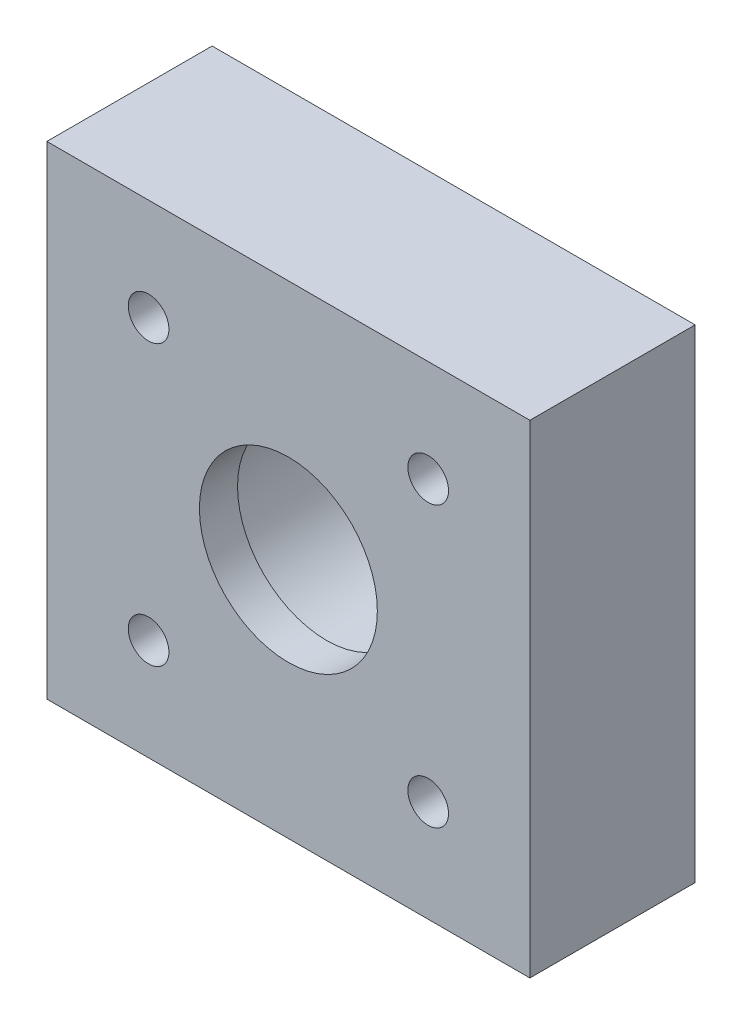
ISO-10303-21;
HEADER;
FILE_DESCRIPTION(('STEP AP214'),'2;1');
FILE_NAME('part.step','',(''),(''),'','','');
FILE_SCHEMA(('AUTOMOTIVE_DESIGN { 1 0 10303 214 1 1 1 1 }'));
ENDSEC;
DATA;
#1=APPLICATION_CONTEXT('core data for automotive mechanical design processes');
#2=APPLICATION_PROTOCOL_DEFINITION('international standard','automotive_design',2000,#1);
#3=PRODUCT_CONTEXT('',#1,'mechanical');
#4=PRODUCT('Part','Part','',(#3));
#5=PRODUCT_RELATED_PRODUCT_CATEGORY('part','',(#4));
#6=PRODUCT_DEFINITION_FORMATION('','',#4);
#7=PRODUCT_DEFINITION_CONTEXT('part definition',#1,'design');
#8=PRODUCT_DEFINITION('design','',#6,#7);
#9=PRODUCT_DEFINITION_SHAPE('','',#8);
#10=(LENGTH_UNIT() NAMED_UNIT(*) SI_UNIT(.MILLI.,.METRE.));
#11=(NAMED_UNIT(*) PLANE_ANGLE_UNIT() SI_UNIT($,.RADIAN.));
#12=(NAMED_UNIT(*) SI_UNIT($,.STERADIAN.) SOLID_ANGLE_UNIT());
#13=UNCERTAINTY_MEASURE_WITH_UNIT(LENGTH_MEASURE(1.E-05),#10,'distance_accuracy_value','');
#14=(GEOMETRIC_REPRESENTATION_CONTEXT(3) GLOBAL_UNCERTAINTY_ASSIGNED_CONTEXT((#13)) GLOBAL_UNIT_ASSIGNED_CONTEXT((#10,
#11,#12)) REPRESENTATION_CONTEXT('',''));
#15=CARTESIAN_POINT('',(0.,0.,0.));
#16=DIRECTION('',(0.,0.,1.));
#17=DIRECTION('',(1.,0.,0.));
#18=AXIS2_PLACEMENT_3D('',#15,#16,#17);
#19=CARTESIAN_POINT('',(0.,0.,3.25));
#20=DIRECTION('',(0.,0.,-1.));
#21=DIRECTION('',(-1.,0.,0.));
#22=AXIS2_PLACEMENT_3D('',#19,#20,#21);
#23=CYLINDRICAL_SURFACE('',#22,3.5);
#24=CARTESIAN_POINT('',(0.,0.,3.25));
#25=DIRECTION('',(0.,0.,1.));
#26=DIRECTION('',(1.,0.,0.));
#27=AXIS2_PLACEMENT_3D('',#24,#25,#26);
#28=CIRCLE('',#27,3.5);
#29=CARTESIAN_POINT('',(3.49999999999999,0.,3.25));
#30=VERTEX_POINT('',#29);
#31=EDGE_CURVE('E102',#30,#30,#28,.T.);
#32=ORIENTED_EDGE('',*,*,#31,.T.);
#33=EDGE_LOOP('',(#32));
#34=FACE_BOUND('',#33,.T.);
#35=CARTESIAN_POINT('',(0.,0.,1.75));
#36=DIRECTION('',(0.,0.,-1.));
#37=DIRECTION('',(-1.,0.,0.));
#38=AXIS2_PLACEMENT_3D('',#35,#36,#37);
#39=CIRCLE('',#38,3.5);
#40=CARTESIAN_POINT('',(-3.50000000000001,0.,1.75));
#41=VERTEX_POINT('',#40);
#42=EDGE_CURVE('E36',#41,#41,#39,.T.);
#43=ORIENTED_EDGE('',*,*,#42,.T.);
#44=EDGE_LOOP('',(#43));
#45=FACE_BOUND('',#44,.T.);
#46=ADVANCED_FACE('F32',(#34,#45),#23,.F.);
#47=CARTESIAN_POINT('',(-9.5,9.5,3.25));
#48=DIRECTION('',(0.,0.,1.));
#49=DIRECTION('',(1.,0.,0.));
#50=AXIS2_PLACEMENT_3D('',#47,#48,#49);
#51=PLANE('',#50);
#52=CARTESIAN_POINT('',(-5.5,5.5,3.25));
#53=DIRECTION('',(0.,0.,1.));
#54=DIRECTION('',(1.,0.,0.));
#55=AXIS2_PLACEMENT_3D('',#52,#53,#54);
#56=CIRCLE('',#55,0.799999999999999);
#57=CARTESIAN_POINT('',(-4.7,5.5,3.25));
#58=VERTEX_POINT('',#57);
#59=EDGE_CURVE('E136',#58,#58,#56,.T.);
#60=ORIENTED_EDGE('',*,*,#59,.F.);
#61=EDGE_LOOP('',(#60));
#62=FACE_BOUND('',#61,.T.);
#63=CARTESIAN_POINT('',(-5.5,-5.5,3.25));
#64=DIRECTION('',(0.,0.,1.));
#65=DIRECTION('',(1.,0.,0.));
#66=AXIS2_PLACEMENT_3D('',#63,#64,#65);
#67=CIRCLE('',#66,0.799999999999999);
#68=CARTESIAN_POINT('',(-4.7,-5.5,3.25));
#69=VERTEX_POINT('',#68);
#70=EDGE_CURVE('E130',#69,#69,#67,.T.);
#71=ORIENTED_EDGE('',*,*,#70,.F.);
#72=EDGE_LOOP('',(#71));
#73=FACE_BOUND('',#72,.T.);
#74=CARTESIAN_POINT('',(5.5,5.5,3.25));
#75=DIRECTION('',(0.,0.,1.));
#76=DIRECTION('',(1.,0.,0.));
#77=AXIS2_PLACEMENT_3D('',#74,#75,#76);
#78=CIRCLE('',#77,0.799999999999999);
#79=CARTESIAN_POINT('',(6.3,5.5,3.25));
#80=VERTEX_POINT('',#79);
#81=EDGE_CURVE('E124',#80,#80,#78,.T.);
#82=ORIENTED_EDGE('',*,*,#81,.F.);
#83=EDGE_LOOP('',(#82));
#84=FACE_BOUND('',#83,.T.);
#85=CARTESIAN_POINT('',(5.5,-5.5,3.25));
#86=DIRECTION('',(0.,0.,1.));
#87=DIRECTION('',(1.,0.,0.));
#88=AXIS2_PLACEMENT_3D('',#85,#86,#87);
#89=CIRCLE('',#88,0.799999999999999);
#90=CARTESIAN_POINT('',(6.3,-5.5,3.25));
#91=VERTEX_POINT('',#90);
#92=EDGE_CURVE('E118',#91,#91,#89,.T.);
#93=ORIENTED_EDGE('',*,*,#92,.F.);
#94=EDGE_LOOP('',(#93));
#95=FACE_BOUND('',#94,.T.);
#96=DIRECTION('',(0.,-1.,0.));
#97=VECTOR('',#96,1.);
#98=CARTESIAN_POINT('',(-9.5,-9.5,3.25));
#99=LINE('',#98,#97);
#100=CARTESIAN_POINT('',(-9.5,9.5,3.25));
#101=VERTEX_POINT('',#100);
#102=CARTESIAN_POINT('',(-9.5,-9.5,3.25));
#103=VERTEX_POINT('',#102);
#104=EDGE_CURVE('E86',#101,#103,#99,.T.);
#105=ORIENTED_EDGE('',*,*,#104,.T.);
#106=DIRECTION('',(1.,0.,0.));
#107=VECTOR('',#106,1.);
#108=CARTESIAN_POINT('',(9.5,-9.5,3.25));
#109=LINE('',#108,#107);
#110=CARTESIAN_POINT('',(9.5,-9.5,3.25));
#111=VERTEX_POINT('',#110);
#112=EDGE_CURVE('E80',#103,#111,#109,.T.);
#113=ORIENTED_EDGE('',*,*,#112,.T.);
#114=DIRECTION('',(0.,1.,0.));
#115=VECTOR('',#114,1.);
#116=CARTESIAN_POINT('',(9.5,-9.5,3.25));
#117=LINE('',#116,#115);
#118=CARTESIAN_POINT('',(9.5,9.5,3.25));
#119=VERTEX_POINT('',#118);
#120=EDGE_CURVE('E84',#111,#119,#117,.T.);
#121=ORIENTED_EDGE('',*,*,#120,.T.);
#122=DIRECTION('',(-1.,0.,0.));
#123=VECTOR('',#122,1.);
#124=CARTESIAN_POINT('',(9.5,9.5,3.25));
#125=LINE('',#124,#123);
#126=EDGE_CURVE('E50',#119,#101,#125,.T.);
#127=ORIENTED_EDGE('',*,*,#126,.T.);
#128=EDGE_LOOP('',(#105,#113,#121,#127));
#129=FACE_BOUND('',#128,.T.);
#130=ORIENTED_EDGE('',*,*,#31,.F.);
#131=EDGE_LOOP('',(#130));
#132=FACE_BOUND('',#131,.T.);
#133=ADVANCED_FACE('F81',(#62,#73,#84,#95,#129,#132),#51,.T.);
#134=CARTESIAN_POINT('',(-9.5,9.5,-3.25));
#135=DIRECTION('',(0.,0.,1.));
#136=DIRECTION('',(1.,0.,0.));
#137=AXIS2_PLACEMENT_3D('',#134,#135,#136);
#138=PLANE('',#137);
#139=CARTESIAN_POINT('',(0.,0.,-3.25));
#140=DIRECTION('',(0.,0.,-1.));
#141=DIRECTION('',(-1.,0.,0.));
#142=AXIS2_PLACEMENT_3D('',#139,#140,#141);
#143=CIRCLE('',#142,4.);
#144=CARTESIAN_POINT('',(-4.,0.,-3.25));
#145=VERTEX_POINT('',#144);
#146=EDGE_CURVE('E139',#145,#145,#143,.T.);
#147=ORIENTED_EDGE('',*,*,#146,.F.);
#148=EDGE_LOOP('',(#147));
#149=FACE_BOUND('',#148,.T.);
#150=CARTESIAN_POINT('',(-5.5,5.5,-3.25));
#151=DIRECTION('',(0.,0.,1.));
#152=DIRECTION('',(1.,0.,0.));
#153=AXIS2_PLACEMENT_3D('',#150,#151,#152);
#154=CIRCLE('',#153,0.799999999999998);
#155=CARTESIAN_POINT('',(-4.7,5.5,-3.25));
#156=VERTEX_POINT('',#155);
#157=EDGE_CURVE('E133',#156,#156,#154,.T.);
#158=ORIENTED_EDGE('',*,*,#157,.T.);
#159=EDGE_LOOP('',(#158));
#160=FACE_BOUND('',#159,.T.);
#161=CARTESIAN_POINT('',(-5.5,-5.5,-3.25));
#162=DIRECTION('',(0.,0.,1.));
#163=DIRECTION('',(1.,0.,0.));
#164=AXIS2_PLACEMENT_3D('',#161,#162,#163);
#165=CIRCLE('',#164,0.799999999999998);
#166=CARTESIAN_POINT('',(-4.7,-5.5,-3.25));
#167=VERTEX_POINT('',#166);
#168=EDGE_CURVE('E127',#167,#167,#165,.T.);
#169=ORIENTED_EDGE('',*,*,#168,.T.);
#170=EDGE_LOOP('',(#169));
#171=FACE_BOUND('',#170,.T.);
#172=CARTESIAN_POINT('',(5.5,5.5,-3.25));
#173=DIRECTION('',(0.,0.,1.));
#174=DIRECTION('',(1.,0.,0.));
#175=AXIS2_PLACEMENT_3D('',#172,#173,#174);
#176=CIRCLE('',#175,0.799999999999998);
#177=CARTESIAN_POINT('',(6.3,5.5,-3.25));
#178=VERTEX_POINT('',#177);
#179=EDGE_CURVE('E121',#178,#178,#176,.T.);
#180=ORIENTED_EDGE('',*,*,#179,.T.);
#181=EDGE_LOOP('',(#180));
#182=FACE_BOUND('',#181,.T.);
#183=CARTESIAN_POINT('',(5.5,-5.5,-3.25));
#184=DIRECTION('',(0.,0.,1.));
#185=DIRECTION('',(1.,0.,0.));
#186=AXIS2_PLACEMENT_3D('',#183,#184,#185);
#187=CIRCLE('',#186,0.799999999999998);
#188=CARTESIAN_POINT('',(6.3,-5.5,-3.25));
#189=VERTEX_POINT('',#188);
#190=EDGE_CURVE('E115',#189,#189,#187,.T.);
#191=ORIENTED_EDGE('',*,*,#190,.T.);
#192=EDGE_LOOP('',(#191));
#193=FACE_BOUND('',#192,.T.);
#194=DIRECTION('',(0.,-1.,0.));
#195=VECTOR('',#194,1.);
#196=CARTESIAN_POINT('',(-9.5,-9.5,-3.25));
#197=LINE('',#196,#195);
#198=CARTESIAN_POINT('',(-9.5,9.5,-3.25));
#199=VERTEX_POINT('',#198);
#200=CARTESIAN_POINT('',(-9.5,-9.5,-3.25));
#201=VERTEX_POINT('',#200);
#202=EDGE_CURVE('E99',#199,#201,#197,.T.);
#203=ORIENTED_EDGE('',*,*,#202,.F.);
#204=DIRECTION('',(-1.,0.,0.));
#205=VECTOR('',#204,1.);
#206=CARTESIAN_POINT('',(9.5,9.5,-3.25));
#207=LINE('',#206,#205);
#208=CARTESIAN_POINT('',(9.5,9.5,-3.25));
#209=VERTEX_POINT('',#208);
#210=EDGE_CURVE('E73',#209,#199,#207,.T.);
#211=ORIENTED_EDGE('',*,*,#210,.F.);
#212=DIRECTION('',(0.,1.,0.));
#213=VECTOR('',#212,1.);
#214=CARTESIAN_POINT('',(9.5,-9.5,-3.25));
#215=LINE('',#214,#213);
#216=CARTESIAN_POINT('',(9.5,-9.5,-3.25));
#217=VERTEX_POINT('',#216);
#218=EDGE_CURVE('E67',#217,#209,#215,.T.);
#219=ORIENTED_EDGE('',*,*,#218,.F.);
#220=DIRECTION('',(1.,0.,0.));
#221=VECTOR('',#220,1.);
#222=CARTESIAN_POINT('',(9.5,-9.5,-3.25));
#223=LINE('',#222,#221);
#224=EDGE_CURVE('E90',#201,#217,#223,.T.);
#225=ORIENTED_EDGE('',*,*,#224,.F.);
#226=EDGE_LOOP('',(#203,#211,#219,#225));
#227=FACE_BOUND('',#226,.T.);
#228=ADVANCED_FACE('F110',(#149,#160,#171,#182,#193,#227),#138,.F.);
#229=CARTESIAN_POINT('',(-9.5,-9.5,3.25));
#230=DIRECTION('',(1.,0.,0.));
#231=DIRECTION('',(0.,0.,-1.));
#232=AXIS2_PLACEMENT_3D('',#229,#230,#231);
#233=PLANE('',#232);
#234=ORIENTED_EDGE('',*,*,#202,.T.);
#235=DIRECTION('',(0.,0.,-1.));
#236=VECTOR('',#235,1.);
#237=CARTESIAN_POINT('',(-9.5,-9.5,3.25));
#238=LINE('',#237,#236);
#239=EDGE_CURVE('E11',#103,#201,#238,.T.);
#240=ORIENTED_EDGE('',*,*,#239,.F.);
#241=ORIENTED_EDGE('',*,*,#104,.F.);
#242=DIRECTION('',(0.,0.,-1.));
#243=VECTOR('',#242,1.);
#244=CARTESIAN_POINT('',(-9.5,9.5,3.25));
#245=LINE('',#244,#243);
#246=EDGE_CURVE('E95',#101,#199,#245,.T.);
#247=ORIENTED_EDGE('',*,*,#246,.T.);
#248=EDGE_LOOP('',(#234,#240,#241,#247));
#249=FACE_BOUND('',#248,.T.);
#250=ADVANCED_FACE('F34',(#249),#233,.F.);
#251=CARTESIAN_POINT('',(9.5,-9.5,3.25));
#252=DIRECTION('',(0.,1.,0.));
#253=DIRECTION('',(-1.,0.,0.));
#254=AXIS2_PLACEMENT_3D('',#251,#252,#253);
#255=PLANE('',#254);
#256=ORIENTED_EDGE('',*,*,#224,.T.);
#257=DIRECTION('',(0.,0.,-1.));
#258=VECTOR('',#257,1.);
#259=CARTESIAN_POINT('',(9.5,-9.5,3.25));
#260=LINE('',#259,#258);
#261=EDGE_CURVE('E42',#111,#217,#260,.T.);
#262=ORIENTED_EDGE('',*,*,#261,.F.);
#263=ORIENTED_EDGE('',*,*,#112,.F.);
#264=ORIENTED_EDGE('',*,*,#239,.T.);
#265=EDGE_LOOP('',(#256,#262,#263,#264));
#266=FACE_BOUND('',#265,.T.);
#267=ADVANCED_FACE('F89',(#266),#255,.F.);
#268=CARTESIAN_POINT('',(9.5,-9.5,3.25));
#269=DIRECTION('',(-1.,0.,0.));
#270=DIRECTION('',(0.,0.,1.));
#271=AXIS2_PLACEMENT_3D('',#268,#269,#270);
#272=PLANE('',#271);
#273=ORIENTED_EDGE('',*,*,#218,.T.);
#274=DIRECTION('',(0.,0.,-1.));
#275=VECTOR('',#274,1.);
#276=CARTESIAN_POINT('',(9.5,9.5,3.25));
#277=LINE('',#276,#275);
#278=EDGE_CURVE('E91',#119,#209,#277,.T.);
#279=ORIENTED_EDGE('',*,*,#278,.F.);
#280=ORIENTED_EDGE('',*,*,#120,.F.);
#281=ORIENTED_EDGE('',*,*,#261,.T.);
#282=EDGE_LOOP('',(#273,#279,#280,#281));
#283=FACE_BOUND('',#282,.T.);
#284=ADVANCED_FACE('F93',(#283),#272,.F.);
#285=CARTESIAN_POINT('',(9.5,9.5,3.25));
#286=DIRECTION('',(0.,-1.,0.));
#287=DIRECTION('',(1.,0.,0.));
#288=AXIS2_PLACEMENT_3D('',#285,#286,#287);
#289=PLANE('',#288);
#290=ORIENTED_EDGE('',*,*,#210,.T.);
#291=ORIENTED_EDGE('',*,*,#246,.F.);
#292=ORIENTED_EDGE('',*,*,#126,.F.);
#293=ORIENTED_EDGE('',*,*,#278,.T.);
#294=EDGE_LOOP('',(#290,#291,#292,#293));
#295=FACE_BOUND('',#294,.T.);
#296=ADVANCED_FACE('F107',(#295),#289,.F.);
#297=CARTESIAN_POINT('',(5.5,-5.5,3.25));
#298=DIRECTION('',(0.,0.,1.));
#299=DIRECTION('',(1.,0.,0.));
#300=AXIS2_PLACEMENT_3D('',#297,#298,#299);
#301=CYLINDRICAL_SURFACE('',#300,0.799999999999998);
#302=ORIENTED_EDGE('',*,*,#92,.T.);
#303=EDGE_LOOP('',(#302));
#304=FACE_BOUND('',#303,.T.);
#305=ORIENTED_EDGE('',*,*,#190,.F.);
#306=EDGE_LOOP('',(#305));
#307=FACE_BOUND('',#306,.T.);
#308=ADVANCED_FACE('F169',(#304,#307),#301,.F.);
#309=CARTESIAN_POINT('',(5.5,5.5,3.25));
#310=DIRECTION('',(0.,0.,1.));
#311=DIRECTION('',(1.,0.,0.));
#312=AXIS2_PLACEMENT_3D('',#309,#310,#311);
#313=CYLINDRICAL_SURFACE('',#312,0.799999999999998);
#314=ORIENTED_EDGE('',*,*,#81,.T.);
#315=EDGE_LOOP('',(#314));
#316=FACE_BOUND('',#315,.T.);
#317=ORIENTED_EDGE('',*,*,#179,.F.);
#318=EDGE_LOOP('',(#317));
#319=FACE_BOUND('',#318,.T.);
#320=ADVANCED_FACE('F206',(#316,#319),#313,.F.);
#321=CARTESIAN_POINT('',(-5.5,-5.5,3.25));
#322=DIRECTION('',(0.,0.,1.));
#323=DIRECTION('',(1.,0.,0.));
#324=AXIS2_PLACEMENT_3D('',#321,#322,#323);
#325=CYLINDRICAL_SURFACE('',#324,0.799999999999998);
#326=ORIENTED_EDGE('',*,*,#70,.T.);
#327=EDGE_LOOP('',(#326));
#328=FACE_BOUND('',#327,.T.);
#329=ORIENTED_EDGE('',*,*,#168,.F.);
#330=EDGE_LOOP('',(#329));
#331=FACE_BOUND('',#330,.T.);
#332=ADVANCED_FACE('F215',(#328,#331),#325,.F.);
#333=CARTESIAN_POINT('',(-5.5,5.5,3.25));
#334=DIRECTION('',(0.,0.,1.));
#335=DIRECTION('',(1.,0.,0.));
#336=AXIS2_PLACEMENT_3D('',#333,#334,#335);
#337=CYLINDRICAL_SURFACE('',#336,0.799999999999998);
#338=ORIENTED_EDGE('',*,*,#59,.T.);
#339=EDGE_LOOP('',(#338));
#340=FACE_BOUND('',#339,.T.);
#341=ORIENTED_EDGE('',*,*,#157,.F.);
#342=EDGE_LOOP('',(#341));
#343=FACE_BOUND('',#342,.T.);
#344=ADVANCED_FACE('F157',(#340,#343),#337,.F.);
#345=CARTESIAN_POINT('',(0.,0.,1.75));
#346=DIRECTION('',(0.,0.,-1.));
#347=DIRECTION('',(-1.,0.,0.));
#348=AXIS2_PLACEMENT_3D('',#345,#346,#347);
#349=CYLINDRICAL_SURFACE('',#348,4.);
#350=CARTESIAN_POINT('',(0.,0.,1.75));
#351=DIRECTION('',(0.,0.,-1.));
#352=DIRECTION('',(-1.,0.,0.));
#353=AXIS2_PLACEMENT_3D('',#350,#351,#352);
#354=CIRCLE('',#353,4.);
#355=CARTESIAN_POINT('',(-4.,0.,1.75));
#356=VERTEX_POINT('',#355);
#357=EDGE_CURVE('E142',#356,#356,#354,.T.);
#358=ORIENTED_EDGE('',*,*,#357,.F.);
#359=EDGE_LOOP('',(#358));
#360=FACE_BOUND('',#359,.T.);
#361=ORIENTED_EDGE('',*,*,#146,.T.);
#362=EDGE_LOOP('',(#361));
#363=FACE_BOUND('',#362,.T.);
#364=ADVANCED_FACE('F152',(#360,#363),#349,.F.);
#365=CARTESIAN_POINT('',(0.,0.,1.75));
#366=DIRECTION('',(0.,0.,-1.));
#367=DIRECTION('',(-1.,0.,0.));
#368=AXIS2_PLACEMENT_3D('',#365,#366,#367);
#369=PLANE('',#368);
#370=ORIENTED_EDGE('',*,*,#42,.F.);
#371=EDGE_LOOP('',(#370));
#372=FACE_BOUND('',#371,.T.);
#373=ORIENTED_EDGE('',*,*,#357,.T.);
#374=EDGE_LOOP('',(#373));
#375=FACE_BOUND('',#374,.T.);
#376=ADVANCED_FACE('F150',(#372,#375),#369,.T.);
#377=CLOSED_SHELL('',(#46,#133,#228,#250,#267,#284,#296,#308,#320,#332,#344,#364,#376));
#378=MANIFOLD_SOLID_BREP('B2',#377);
#379=ADVANCED_BREP_SHAPE_REPRESENTATION('',(#18,#378),#14);
#380=SHAPE_DEFINITION_REPRESENTATION(#9,#379);
ENDSEC;
END-ISO-10303-21;
